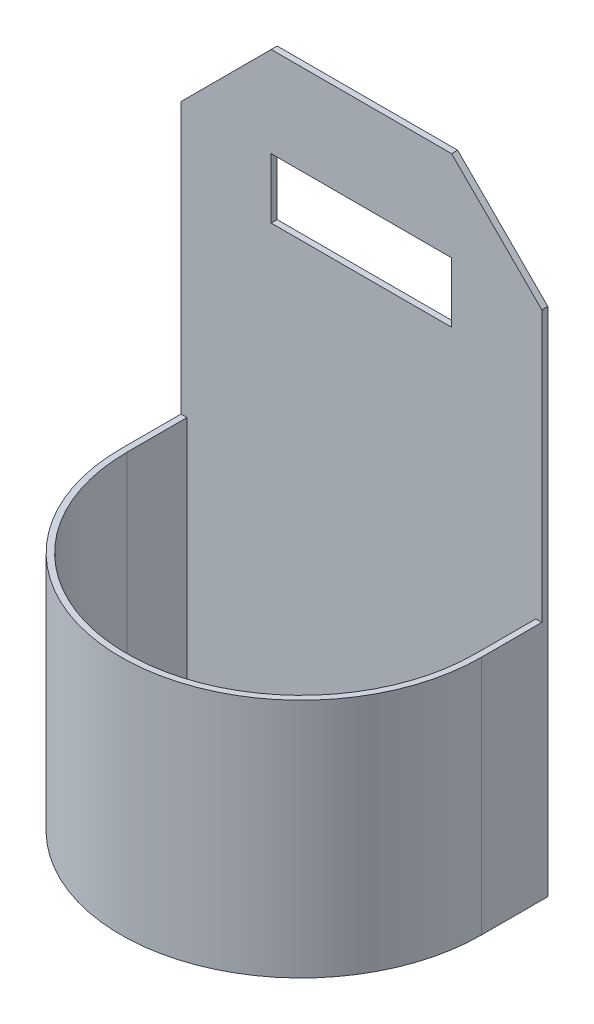
ISO-10303-21;
HEADER;
FILE_DESCRIPTION(('STEP AP214'),'2;1');
FILE_NAME('part.step','',(''),(''),'','','');
FILE_SCHEMA(('AUTOMOTIVE_DESIGN { 1 0 10303 214 1 1 1 1 }'));
ENDSEC;
DATA;
#1=APPLICATION_CONTEXT('core data for automotive mechanical design processes');
#2=APPLICATION_PROTOCOL_DEFINITION('international standard','automotive_design',2000,#1);
#3=PRODUCT_CONTEXT('',#1,'mechanical');
#4=PRODUCT('Part','Part','',(#3));
#5=PRODUCT_RELATED_PRODUCT_CATEGORY('part','',(#4));
#6=PRODUCT_DEFINITION_FORMATION('','',#4);
#7=PRODUCT_DEFINITION_CONTEXT('part definition',#1,'design');
#8=PRODUCT_DEFINITION('design','',#6,#7);
#9=PRODUCT_DEFINITION_SHAPE('','',#8);
#10=(LENGTH_UNIT() NAMED_UNIT(*) SI_UNIT(.MILLI.,.METRE.));
#11=(NAMED_UNIT(*) PLANE_ANGLE_UNIT() SI_UNIT($,.RADIAN.));
#12=(NAMED_UNIT(*) SI_UNIT($,.STERADIAN.) SOLID_ANGLE_UNIT());
#13=UNCERTAINTY_MEASURE_WITH_UNIT(LENGTH_MEASURE(1.E-05),#10,'distance_accuracy_value','');
#14=(GEOMETRIC_REPRESENTATION_CONTEXT(3) GLOBAL_UNCERTAINTY_ASSIGNED_CONTEXT((#13)) GLOBAL_UNIT_ASSIGNED_CONTEXT((#10,
#11,#12)) REPRESENTATION_CONTEXT('',''));
#15=CARTESIAN_POINT('',(0.,0.,0.));
#16=DIRECTION('',(0.,0.,1.));
#17=DIRECTION('',(1.,0.,0.));
#18=AXIS2_PLACEMENT_3D('',#15,#16,#17);
#19=CARTESIAN_POINT('',(0.,100.,1.));
#20=DIRECTION('',(0.,0.,-1.));
#21=DIRECTION('',(-1.,0.,0.));
#22=AXIS2_PLACEMENT_3D('',#19,#20,#21);
#23=PLANE('',#22);
#24=DIRECTION('',(0.,1.,0.));
#25=VECTOR('',#24,1.);
#26=CARTESIAN_POINT('',(45.,85.,1.));
#27=LINE('',#26,#25);
#28=CARTESIAN_POINT('',(45.,75.,1.));
#29=VERTEX_POINT('',#28);
#30=CARTESIAN_POINT('',(45.,85.,1.));
#31=VERTEX_POINT('',#30);
#32=EDGE_CURVE('E232',#29,#31,#27,.T.);
#33=ORIENTED_EDGE('',*,*,#32,.F.);
#34=DIRECTION('',(1.,0.,0.));
#35=VECTOR('',#34,1.);
#36=CARTESIAN_POINT('',(15.,75.,1.));
#37=LINE('',#36,#35);
#38=CARTESIAN_POINT('',(15.,75.,1.));
#39=VERTEX_POINT('',#38);
#40=EDGE_CURVE('E240',#39,#29,#37,.T.);
#41=ORIENTED_EDGE('',*,*,#40,.F.);
#42=DIRECTION('',(0.,-1.,0.));
#43=VECTOR('',#42,1.);
#44=CARTESIAN_POINT('',(15.,85.,1.));
#45=LINE('',#44,#43);
#46=CARTESIAN_POINT('',(15.,85.,1.));
#47=VERTEX_POINT('',#46);
#48=EDGE_CURVE('E237',#47,#39,#45,.T.);
#49=ORIENTED_EDGE('',*,*,#48,.F.);
#50=DIRECTION('',(-1.,0.,0.));
#51=VECTOR('',#50,1.);
#52=CARTESIAN_POINT('',(15.,85.,1.));
#53=LINE('',#52,#51);
#54=EDGE_CURVE('E234',#31,#47,#53,.T.);
#55=ORIENTED_EDGE('',*,*,#54,.F.);
#56=EDGE_LOOP('',(#33,#41,#49,#55));
#57=FACE_BOUND('',#56,.T.);
#58=DIRECTION('',(-1.,0.,0.));
#59=VECTOR('',#58,1.);
#60=CARTESIAN_POINT('',(0.,40.,1.));
#61=LINE('',#60,#59);
#62=CARTESIAN_POINT('',(60.,40.,1.));
#63=VERTEX_POINT('',#62);
#64=CARTESIAN_POINT('',(59.,40.,1.));
#65=VERTEX_POINT('',#64);
#66=EDGE_CURVE('E57',#63,#65,#61,.T.);
#67=ORIENTED_EDGE('',*,*,#66,.F.);
#68=DIRECTION('',(0.,1.,0.));
#69=VECTOR('',#68,1.);
#70=CARTESIAN_POINT('',(60.,0.,1.));
#71=LINE('',#70,#69);
#72=CARTESIAN_POINT('',(60.,85.,1.));
#73=VERTEX_POINT('',#72);
#74=EDGE_CURVE('E190',#63,#73,#71,.T.);
#75=ORIENTED_EDGE('',*,*,#74,.T.);
#76=DIRECTION('',(-0.707106781186547,0.707106781186547,0.));
#77=VECTOR('',#76,1.);
#78=CARTESIAN_POINT('',(45.,100.,1.));
#79=LINE('',#78,#77);
#80=CARTESIAN_POINT('',(45.,100.,1.));
#81=VERTEX_POINT('',#80);
#82=EDGE_CURVE('E288',#73,#81,#79,.T.);
#83=ORIENTED_EDGE('',*,*,#82,.T.);
#84=DIRECTION('',(-1.,0.,0.));
#85=VECTOR('',#84,1.);
#86=CARTESIAN_POINT('',(15.,100.,1.));
#87=LINE('',#86,#85);
#88=CARTESIAN_POINT('',(15.,100.,1.));
#89=VERTEX_POINT('',#88);
#90=EDGE_CURVE('E287',#81,#89,#87,.T.);
#91=ORIENTED_EDGE('',*,*,#90,.T.);
#92=DIRECTION('',(-0.707106781186547,-0.707106781186547,0.));
#93=VECTOR('',#92,1.);
#94=CARTESIAN_POINT('',(0.,85.,1.));
#95=LINE('',#94,#93);
#96=CARTESIAN_POINT('',(0.,85.,1.));
#97=VERTEX_POINT('',#96);
#98=EDGE_CURVE('E209',#89,#97,#95,.T.);
#99=ORIENTED_EDGE('',*,*,#98,.T.);
#100=DIRECTION('',(0.,-1.,0.));
#101=VECTOR('',#100,1.);
#102=CARTESIAN_POINT('',(0.,0.,1.));
#103=LINE('',#102,#101);
#104=CARTESIAN_POINT('',(0.,40.,1.));
#105=VERTEX_POINT('',#104);
#106=EDGE_CURVE('E207',#97,#105,#103,.T.);
#107=ORIENTED_EDGE('',*,*,#106,.T.);
#108=CARTESIAN_POINT('',(1.,40.,1.));
#109=VERTEX_POINT('',#108);
#110=EDGE_CURVE('E35',#109,#105,#61,.T.);
#111=ORIENTED_EDGE('',*,*,#110,.F.);
#112=DIRECTION('',(0.,-1.,0.));
#113=VECTOR('',#112,1.);
#114=CARTESIAN_POINT('',(1.,100.,1.));
#115=LINE('',#114,#113);
#116=CARTESIAN_POINT('',(1.,1.,1.));
#117=VERTEX_POINT('',#116);
#118=EDGE_CURVE('E176',#109,#117,#115,.T.);
#119=ORIENTED_EDGE('',*,*,#118,.T.);
#120=DIRECTION('',(1.,0.,0.));
#121=VECTOR('',#120,1.);
#122=CARTESIAN_POINT('',(0.,1.,1.));
#123=LINE('',#122,#121);
#124=CARTESIAN_POINT('',(59.,1.,1.));
#125=VERTEX_POINT('',#124);
#126=EDGE_CURVE('E154',#117,#125,#123,.T.);
#127=ORIENTED_EDGE('',*,*,#126,.T.);
#128=DIRECTION('',(0.,1.,0.));
#129=VECTOR('',#128,1.);
#130=CARTESIAN_POINT('',(59.,100.,1.));
#131=LINE('',#130,#129);
#132=EDGE_CURVE('E487',#125,#65,#131,.T.);
#133=ORIENTED_EDGE('',*,*,#132,.T.);
#134=EDGE_LOOP('',(#67,#75,#83,#91,#99,#107,#111,#119,#127,#133));
#135=FACE_BOUND('',#134,.T.);
#136=ADVANCED_FACE('F31',(#57,#135),#23,.F.);
#137=CARTESIAN_POINT('',(0.,100.,0.));
#138=DIRECTION('',(0.,0.,-1.));
#139=DIRECTION('',(-1.,0.,0.));
#140=AXIS2_PLACEMENT_3D('',#137,#138,#139);
#141=PLANE('',#140);
#142=DIRECTION('',(0.,-1.,0.));
#143=VECTOR('',#142,1.);
#144=CARTESIAN_POINT('',(0.,0.,0.));
#145=LINE('',#144,#143);
#146=CARTESIAN_POINT('',(0.,85.,0.));
#147=VERTEX_POINT('',#146);
#148=CARTESIAN_POINT('',(0.,0.,0.));
#149=VERTEX_POINT('',#148);
#150=EDGE_CURVE('E259',#147,#149,#145,.T.);
#151=ORIENTED_EDGE('',*,*,#150,.F.);
#152=DIRECTION('',(-0.707106781186547,-0.707106781186547,0.));
#153=VECTOR('',#152,1.);
#154=CARTESIAN_POINT('',(0.,85.,0.));
#155=LINE('',#154,#153);
#156=CARTESIAN_POINT('',(15.,100.,0.));
#157=VERTEX_POINT('',#156);
#158=EDGE_CURVE('E213',#157,#147,#155,.T.);
#159=ORIENTED_EDGE('',*,*,#158,.F.);
#160=DIRECTION('',(-1.,0.,0.));
#161=VECTOR('',#160,1.);
#162=CARTESIAN_POINT('',(15.,100.,0.));
#163=LINE('',#162,#161);
#164=CARTESIAN_POINT('',(45.,100.,0.));
#165=VERTEX_POINT('',#164);
#166=EDGE_CURVE('E277',#165,#157,#163,.T.);
#167=ORIENTED_EDGE('',*,*,#166,.F.);
#168=DIRECTION('',(-0.707106781186547,0.707106781186547,0.));
#169=VECTOR('',#168,1.);
#170=CARTESIAN_POINT('',(45.,100.,0.));
#171=LINE('',#170,#169);
#172=CARTESIAN_POINT('',(60.,85.,0.));
#173=VERTEX_POINT('',#172);
#174=EDGE_CURVE('E279',#173,#165,#171,.T.);
#175=ORIENTED_EDGE('',*,*,#174,.F.);
#176=DIRECTION('',(0.,1.,0.));
#177=VECTOR('',#176,1.);
#178=CARTESIAN_POINT('',(60.,0.,0.));
#179=LINE('',#178,#177);
#180=CARTESIAN_POINT('',(60.,0.,0.));
#181=VERTEX_POINT('',#180);
#182=EDGE_CURVE('E281',#181,#173,#179,.T.);
#183=ORIENTED_EDGE('',*,*,#182,.F.);
#184=DIRECTION('',(1.,0.,0.));
#185=VECTOR('',#184,1.);
#186=CARTESIAN_POINT('',(0.,0.,0.));
#187=LINE('',#186,#185);
#188=EDGE_CURVE('E283',#149,#181,#187,.T.);
#189=ORIENTED_EDGE('',*,*,#188,.F.);
#190=EDGE_LOOP('',(#151,#159,#167,#175,#183,#189));
#191=FACE_BOUND('',#190,.T.);
#192=DIRECTION('',(1.,0.,0.));
#193=VECTOR('',#192,1.);
#194=CARTESIAN_POINT('',(15.,75.,0.));
#195=LINE('',#194,#193);
#196=CARTESIAN_POINT('',(15.,75.,0.));
#197=VERTEX_POINT('',#196);
#198=CARTESIAN_POINT('',(45.,75.,0.));
#199=VERTEX_POINT('',#198);
#200=EDGE_CURVE('E235',#197,#199,#195,.T.);
#201=ORIENTED_EDGE('',*,*,#200,.T.);
#202=DIRECTION('',(0.,1.,0.));
#203=VECTOR('',#202,1.);
#204=CARTESIAN_POINT('',(45.,85.,0.));
#205=LINE('',#204,#203);
#206=CARTESIAN_POINT('',(45.,85.,0.));
#207=VERTEX_POINT('',#206);
#208=EDGE_CURVE('E226',#199,#207,#205,.T.);
#209=ORIENTED_EDGE('',*,*,#208,.T.);
#210=DIRECTION('',(-1.,0.,0.));
#211=VECTOR('',#210,1.);
#212=CARTESIAN_POINT('',(15.,85.,0.));
#213=LINE('',#212,#211);
#214=CARTESIAN_POINT('',(15.,85.,0.));
#215=VERTEX_POINT('',#214);
#216=EDGE_CURVE('E229',#207,#215,#213,.T.);
#217=ORIENTED_EDGE('',*,*,#216,.T.);
#218=DIRECTION('',(0.,-1.,0.));
#219=VECTOR('',#218,1.);
#220=CARTESIAN_POINT('',(15.,85.,0.));
#221=LINE('',#220,#219);
#222=EDGE_CURVE('E245',#215,#197,#221,.T.);
#223=ORIENTED_EDGE('',*,*,#222,.T.);
#224=EDGE_LOOP('',(#201,#209,#217,#223));
#225=FACE_BOUND('',#224,.T.);
#226=ADVANCED_FACE('F307',(#191,#225),#141,.T.);
#227=CARTESIAN_POINT('',(0.,0.,1.));
#228=DIRECTION('',(1.,0.,0.));
#229=DIRECTION('',(0.,0.,-1.));
#230=AXIS2_PLACEMENT_3D('',#227,#228,#229);
#231=PLANE('',#230);
#232=ORIENTED_EDGE('',*,*,#150,.T.);
#233=DIRECTION('',(0.,0.,-1.));
#234=VECTOR('',#233,1.);
#235=CARTESIAN_POINT('',(0.,0.,1.));
#236=LINE('',#235,#234);
#237=CARTESIAN_POINT('',(0.,0.,11.));
#238=VERTEX_POINT('',#237);
#239=EDGE_CURVE('E11',#238,#149,#236,.T.);
#240=ORIENTED_EDGE('',*,*,#239,.F.);
#241=DIRECTION('',(0.,-1.,0.));
#242=VECTOR('',#241,1.);
#243=CARTESIAN_POINT('',(0.,40.,11.));
#244=LINE('',#243,#242);
#245=CARTESIAN_POINT('',(0.,40.,11.));
#246=VERTEX_POINT('',#245);
#247=EDGE_CURVE('E194',#246,#238,#244,.T.);
#248=ORIENTED_EDGE('',*,*,#247,.F.);
#249=DIRECTION('',(0.,0.,1.));
#250=VECTOR('',#249,1.);
#251=CARTESIAN_POINT('',(0.,40.,1.));
#252=LINE('',#251,#250);
#253=EDGE_CURVE('E189',#105,#246,#252,.T.);
#254=ORIENTED_EDGE('',*,*,#253,.F.);
#255=ORIENTED_EDGE('',*,*,#106,.F.);
#256=DIRECTION('',(0.,0.,-1.));
#257=VECTOR('',#256,1.);
#258=CARTESIAN_POINT('',(0.,85.,1.));
#259=LINE('',#258,#257);
#260=EDGE_CURVE('E274',#97,#147,#259,.T.);
#261=ORIENTED_EDGE('',*,*,#260,.T.);
#262=EDGE_LOOP('',(#232,#240,#248,#254,#255,#261));
#263=FACE_BOUND('',#262,.T.);
#264=ADVANCED_FACE('F33',(#263),#231,.F.);
#265=CARTESIAN_POINT('',(0.,0.,1.));
#266=DIRECTION('',(0.,1.,0.));
#267=DIRECTION('',(0.,0.,1.));
#268=AXIS2_PLACEMENT_3D('',#265,#266,#267);
#269=PLANE('',#268);
#270=ORIENTED_EDGE('',*,*,#188,.T.);
#271=DIRECTION('',(0.,0.,-1.));
#272=VECTOR('',#271,1.);
#273=CARTESIAN_POINT('',(60.,0.,1.));
#274=LINE('',#273,#272);
#275=CARTESIAN_POINT('',(60.,0.,11.));
#276=VERTEX_POINT('',#275);
#277=EDGE_CURVE('E41',#276,#181,#274,.T.);
#278=ORIENTED_EDGE('',*,*,#277,.F.);
#279=CARTESIAN_POINT('',(30.,0.,11.));
#280=DIRECTION('',(0.,1.,0.));
#281=DIRECTION('',(0.,0.,1.));
#282=AXIS2_PLACEMENT_3D('',#279,#280,#281);
#283=CIRCLE('',#282,30.);
#284=EDGE_CURVE('E156',#238,#276,#283,.T.);
#285=ORIENTED_EDGE('',*,*,#284,.F.);
#286=ORIENTED_EDGE('',*,*,#239,.T.);
#287=EDGE_LOOP('',(#270,#278,#285,#286));
#288=FACE_BOUND('',#287,.T.);
#289=ADVANCED_FACE('F310',(#288),#269,.F.);
#290=CARTESIAN_POINT('',(60.,0.,1.));
#291=DIRECTION('',(-1.,0.,0.));
#292=DIRECTION('',(0.,-1.,0.));
#293=AXIS2_PLACEMENT_3D('',#290,#291,#292);
#294=PLANE('',#293);
#295=ORIENTED_EDGE('',*,*,#182,.T.);
#296=DIRECTION('',(0.,0.,-1.));
#297=VECTOR('',#296,1.);
#298=CARTESIAN_POINT('',(60.,85.,1.));
#299=LINE('',#298,#297);
#300=EDGE_CURVE('E265',#73,#173,#299,.T.);
#301=ORIENTED_EDGE('',*,*,#300,.F.);
#302=ORIENTED_EDGE('',*,*,#74,.F.);
#303=DIRECTION('',(0.,0.,-1.));
#304=VECTOR('',#303,1.);
#305=CARTESIAN_POINT('',(60.,40.,0.999999999999984));
#306=LINE('',#305,#304);
#307=CARTESIAN_POINT('',(60.,40.,11.));
#308=VERTEX_POINT('',#307);
#309=EDGE_CURVE('E181',#308,#63,#306,.T.);
#310=ORIENTED_EDGE('',*,*,#309,.F.);
#311=DIRECTION('',(0.,-1.,0.));
#312=VECTOR('',#311,1.);
#313=CARTESIAN_POINT('',(60.,40.,11.));
#314=LINE('',#313,#312);
#315=EDGE_CURVE('E220',#308,#276,#314,.T.);
#316=ORIENTED_EDGE('',*,*,#315,.T.);
#317=ORIENTED_EDGE('',*,*,#277,.T.);
#318=EDGE_LOOP('',(#295,#301,#302,#310,#316,#317));
#319=FACE_BOUND('',#318,.T.);
#320=ADVANCED_FACE('F292',(#319),#294,.F.);
#321=CARTESIAN_POINT('',(45.,100.,1.));
#322=DIRECTION('',(-0.707106781186547,-0.707106781186547,0.));
#323=DIRECTION('',(0.707106781186548,-0.707106781186548,0.));
#324=AXIS2_PLACEMENT_3D('',#321,#322,#323);
#325=PLANE('',#324);
#326=ORIENTED_EDGE('',*,*,#174,.T.);
#327=DIRECTION('',(0.,0.,-1.));
#328=VECTOR('',#327,1.);
#329=CARTESIAN_POINT('',(45.,100.,1.));
#330=LINE('',#329,#328);
#331=EDGE_CURVE('E268',#81,#165,#330,.T.);
#332=ORIENTED_EDGE('',*,*,#331,.F.);
#333=ORIENTED_EDGE('',*,*,#82,.F.);
#334=ORIENTED_EDGE('',*,*,#300,.T.);
#335=EDGE_LOOP('',(#326,#332,#333,#334));
#336=FACE_BOUND('',#335,.T.);
#337=ADVANCED_FACE('F296',(#336),#325,.F.);
#338=CARTESIAN_POINT('',(15.,100.,1.));
#339=DIRECTION('',(0.,-1.,0.));
#340=DIRECTION('',(0.,0.,-1.));
#341=AXIS2_PLACEMENT_3D('',#338,#339,#340);
#342=PLANE('',#341);
#343=ORIENTED_EDGE('',*,*,#166,.T.);
#344=DIRECTION('',(0.,0.,-1.));
#345=VECTOR('',#344,1.);
#346=CARTESIAN_POINT('',(15.,100.,1.));
#347=LINE('',#346,#345);
#348=EDGE_CURVE('E271',#89,#157,#347,.T.);
#349=ORIENTED_EDGE('',*,*,#348,.F.);
#350=ORIENTED_EDGE('',*,*,#90,.F.);
#351=ORIENTED_EDGE('',*,*,#331,.T.);
#352=EDGE_LOOP('',(#343,#349,#350,#351));
#353=FACE_BOUND('',#352,.T.);
#354=ADVANCED_FACE('F301',(#353),#342,.F.);
#355=CARTESIAN_POINT('',(0.,85.,1.));
#356=DIRECTION('',(0.707106781186547,-0.707106781186547,0.));
#357=DIRECTION('',(0.707106781186548,0.707106781186548,0.));
#358=AXIS2_PLACEMENT_3D('',#355,#356,#357);
#359=PLANE('',#358);
#360=ORIENTED_EDGE('',*,*,#158,.T.);
#361=ORIENTED_EDGE('',*,*,#260,.F.);
#362=ORIENTED_EDGE('',*,*,#98,.F.);
#363=ORIENTED_EDGE('',*,*,#348,.T.);
#364=EDGE_LOOP('',(#360,#361,#362,#363));
#365=FACE_BOUND('',#364,.T.);
#366=ADVANCED_FACE('F304',(#365),#359,.F.);
#367=CARTESIAN_POINT('',(45.,85.,1.));
#368=DIRECTION('',(-1.,0.,0.));
#369=DIRECTION('',(0.,0.,1.));
#370=AXIS2_PLACEMENT_3D('',#367,#368,#369);
#371=PLANE('',#370);
#372=ORIENTED_EDGE('',*,*,#208,.F.);
#373=DIRECTION('',(0.,0.,-1.));
#374=VECTOR('',#373,1.);
#375=CARTESIAN_POINT('',(45.,75.,1.));
#376=LINE('',#375,#374);
#377=EDGE_CURVE('E241',#29,#199,#376,.T.);
#378=ORIENTED_EDGE('',*,*,#377,.F.);
#379=ORIENTED_EDGE('',*,*,#32,.T.);
#380=DIRECTION('',(0.,0.,-1.));
#381=VECTOR('',#380,1.);
#382=CARTESIAN_POINT('',(45.,85.,1.));
#383=LINE('',#382,#381);
#384=EDGE_CURVE('E256',#31,#207,#383,.T.);
#385=ORIENTED_EDGE('',*,*,#384,.T.);
#386=EDGE_LOOP('',(#372,#378,#379,#385));
#387=FACE_BOUND('',#386,.T.);
#388=ADVANCED_FACE('F326',(#387),#371,.T.);
#389=CARTESIAN_POINT('',(15.,85.,1.));
#390=DIRECTION('',(0.,-1.,0.));
#391=DIRECTION('',(0.,0.,-1.));
#392=AXIS2_PLACEMENT_3D('',#389,#390,#391);
#393=PLANE('',#392);
#394=ORIENTED_EDGE('',*,*,#216,.F.);
#395=ORIENTED_EDGE('',*,*,#384,.F.);
#396=ORIENTED_EDGE('',*,*,#54,.T.);
#397=DIRECTION('',(0.,0.,-1.));
#398=VECTOR('',#397,1.);
#399=CARTESIAN_POINT('',(15.,85.,1.));
#400=LINE('',#399,#398);
#401=EDGE_CURVE('E254',#47,#215,#400,.T.);
#402=ORIENTED_EDGE('',*,*,#401,.T.);
#403=EDGE_LOOP('',(#394,#395,#396,#402));
#404=FACE_BOUND('',#403,.T.);
#405=ADVANCED_FACE('F353',(#404),#393,.T.);
#406=CARTESIAN_POINT('',(15.,85.,1.));
#407=DIRECTION('',(1.,0.,0.));
#408=DIRECTION('',(0.,1.,0.));
#409=AXIS2_PLACEMENT_3D('',#406,#407,#408);
#410=PLANE('',#409);
#411=ORIENTED_EDGE('',*,*,#222,.F.);
#412=ORIENTED_EDGE('',*,*,#401,.F.);
#413=ORIENTED_EDGE('',*,*,#48,.T.);
#414=DIRECTION('',(0.,0.,-1.));
#415=VECTOR('',#414,1.);
#416=CARTESIAN_POINT('',(15.,75.,1.));
#417=LINE('',#416,#415);
#418=EDGE_CURVE('E252',#39,#197,#417,.T.);
#419=ORIENTED_EDGE('',*,*,#418,.T.);
#420=EDGE_LOOP('',(#411,#412,#413,#419));
#421=FACE_BOUND('',#420,.T.);
#422=ADVANCED_FACE('F360',(#421),#410,.T.);
#423=CARTESIAN_POINT('',(15.,75.,1.));
#424=DIRECTION('',(0.,1.,0.));
#425=DIRECTION('',(0.,0.,1.));
#426=AXIS2_PLACEMENT_3D('',#423,#424,#425);
#427=PLANE('',#426);
#428=ORIENTED_EDGE('',*,*,#200,.F.);
#429=ORIENTED_EDGE('',*,*,#418,.F.);
#430=ORIENTED_EDGE('',*,*,#40,.T.);
#431=ORIENTED_EDGE('',*,*,#377,.T.);
#432=EDGE_LOOP('',(#428,#429,#430,#431));
#433=FACE_BOUND('',#432,.T.);
#434=ADVANCED_FACE('F367',(#433),#427,.T.);
#435=CARTESIAN_POINT('',(30.,40.,11.));
#436=DIRECTION('',(0.,-1.,0.));
#437=DIRECTION('',(0.,0.,-1.));
#438=AXIS2_PLACEMENT_3D('',#435,#436,#437);
#439=CYLINDRICAL_SURFACE('',#438,30.);
#440=ORIENTED_EDGE('',*,*,#284,.T.);
#441=ORIENTED_EDGE('',*,*,#315,.F.);
#442=CARTESIAN_POINT('',(30.,40.,11.));
#443=DIRECTION('',(0.,1.,0.));
#444=DIRECTION('',(0.,0.,1.));
#445=AXIS2_PLACEMENT_3D('',#442,#443,#444);
#446=CIRCLE('',#445,30.);
#447=EDGE_CURVE('E179',#246,#308,#446,.T.);
#448=ORIENTED_EDGE('',*,*,#447,.F.);
#449=ORIENTED_EDGE('',*,*,#247,.T.);
#450=EDGE_LOOP('',(#440,#441,#448,#449));
#451=FACE_BOUND('',#450,.T.);
#452=ADVANCED_FACE('F222',(#451),#439,.T.);
#453=CARTESIAN_POINT('',(30.,40.,11.));
#454=DIRECTION('',(0.,1.,0.));
#455=DIRECTION('',(0.,0.,1.));
#456=AXIS2_PLACEMENT_3D('',#453,#454,#455);
#457=PLANE('',#456);
#458=DIRECTION('',(0.,0.,-1.));
#459=VECTOR('',#458,1.);
#460=CARTESIAN_POINT('',(59.,40.,1.));
#461=LINE('',#460,#459);
#462=CARTESIAN_POINT('',(59.,40.,11.));
#463=VERTEX_POINT('',#462);
#464=EDGE_CURVE('E170',#463,#65,#461,.T.);
#465=ORIENTED_EDGE('',*,*,#464,.F.);
#466=CARTESIAN_POINT('',(30.,40.,11.));
#467=DIRECTION('',(0.,1.,0.));
#468=DIRECTION('',(0.,0.,1.));
#469=AXIS2_PLACEMENT_3D('',#466,#467,#468);
#470=CIRCLE('',#469,29.);
#471=CARTESIAN_POINT('',(1.,40.,11.));
#472=VERTEX_POINT('',#471);
#473=EDGE_CURVE('E168',#472,#463,#470,.T.);
#474=ORIENTED_EDGE('',*,*,#473,.F.);
#475=DIRECTION('',(0.,0.,1.));
#476=VECTOR('',#475,1.);
#477=CARTESIAN_POINT('',(1.,40.,1.));
#478=LINE('',#477,#476);
#479=EDGE_CURVE('E161',#109,#472,#478,.T.);
#480=ORIENTED_EDGE('',*,*,#479,.F.);
#481=ORIENTED_EDGE('',*,*,#110,.T.);
#482=ORIENTED_EDGE('',*,*,#253,.T.);
#483=ORIENTED_EDGE('',*,*,#447,.T.);
#484=ORIENTED_EDGE('',*,*,#309,.T.);
#485=ORIENTED_EDGE('',*,*,#66,.T.);
#486=EDGE_LOOP('',(#465,#474,#480,#481,#482,#483,#484,#485));
#487=FACE_BOUND('',#486,.T.);
#488=ADVANCED_FACE('F203',(#487),#457,.T.);
#489=CARTESIAN_POINT('',(1.,0.,1.));
#490=DIRECTION('',(1.,0.,0.));
#491=DIRECTION('',(0.,0.,-1.));
#492=AXIS2_PLACEMENT_3D('',#489,#490,#491);
#493=PLANE('',#492);
#494=ORIENTED_EDGE('',*,*,#479,.T.);
#495=DIRECTION('',(0.,-1.,0.));
#496=VECTOR('',#495,1.);
#497=CARTESIAN_POINT('',(0.999999999999997,40.,11.));
#498=LINE('',#497,#496);
#499=CARTESIAN_POINT('',(0.999999999999997,1.,11.));
#500=VERTEX_POINT('',#499);
#501=EDGE_CURVE('E49',#472,#500,#498,.T.);
#502=ORIENTED_EDGE('',*,*,#501,.T.);
#503=DIRECTION('',(0.,0.,-1.));
#504=VECTOR('',#503,1.);
#505=CARTESIAN_POINT('',(1.,1.,1.));
#506=LINE('',#505,#504);
#507=EDGE_CURVE('E150',#500,#117,#506,.T.);
#508=ORIENTED_EDGE('',*,*,#507,.T.);
#509=ORIENTED_EDGE('',*,*,#118,.F.);
#510=EDGE_LOOP('',(#494,#502,#508,#509));
#511=FACE_BOUND('',#510,.T.);
#512=ADVANCED_FACE('F159',(#511),#493,.T.);
#513=CARTESIAN_POINT('',(0.,1.,1.));
#514=DIRECTION('',(0.,1.,0.));
#515=DIRECTION('',(0.,0.,1.));
#516=AXIS2_PLACEMENT_3D('',#513,#514,#515);
#517=PLANE('',#516);
#518=ORIENTED_EDGE('',*,*,#126,.F.);
#519=ORIENTED_EDGE('',*,*,#507,.F.);
#520=CARTESIAN_POINT('',(30.,1.,11.));
#521=DIRECTION('',(0.,1.,0.));
#522=DIRECTION('',(0.,0.,1.));
#523=AXIS2_PLACEMENT_3D('',#520,#521,#522);
#524=CIRCLE('',#523,29.);
#525=CARTESIAN_POINT('',(59.,1.,11.));
#526=VERTEX_POINT('',#525);
#527=EDGE_CURVE('E153',#500,#526,#524,.T.);
#528=ORIENTED_EDGE('',*,*,#527,.T.);
#529=DIRECTION('',(0.,0.,-1.));
#530=VECTOR('',#529,1.);
#531=CARTESIAN_POINT('',(59.,1.,1.));
#532=LINE('',#531,#530);
#533=EDGE_CURVE('E157',#526,#125,#532,.T.);
#534=ORIENTED_EDGE('',*,*,#533,.T.);
#535=EDGE_LOOP('',(#518,#519,#528,#534));
#536=FACE_BOUND('',#535,.T.);
#537=ADVANCED_FACE('F151',(#536),#517,.T.);
#538=CARTESIAN_POINT('',(59.,0.,1.));
#539=DIRECTION('',(-1.,0.,0.));
#540=DIRECTION('',(0.,-1.,0.));
#541=AXIS2_PLACEMENT_3D('',#538,#539,#540);
#542=PLANE('',#541);
#543=ORIENTED_EDGE('',*,*,#132,.F.);
#544=ORIENTED_EDGE('',*,*,#533,.F.);
#545=DIRECTION('',(0.,-1.,0.));
#546=VECTOR('',#545,1.);
#547=CARTESIAN_POINT('',(59.,0.,11.));
#548=LINE('',#547,#546);
#549=EDGE_CURVE('E163',#463,#526,#548,.T.);
#550=ORIENTED_EDGE('',*,*,#549,.F.);
#551=ORIENTED_EDGE('',*,*,#464,.T.);
#552=EDGE_LOOP('',(#543,#544,#550,#551));
#553=FACE_BOUND('',#552,.T.);
#554=ADVANCED_FACE('F401',(#553),#542,.T.);
#555=CARTESIAN_POINT('',(30.,40.,11.));
#556=DIRECTION('',(0.,-1.,0.));
#557=DIRECTION('',(0.,0.,-1.));
#558=AXIS2_PLACEMENT_3D('',#555,#556,#557);
#559=CYLINDRICAL_SURFACE('',#558,29.);
#560=ORIENTED_EDGE('',*,*,#527,.F.);
#561=ORIENTED_EDGE('',*,*,#501,.F.);
#562=ORIENTED_EDGE('',*,*,#473,.T.);
#563=ORIENTED_EDGE('',*,*,#549,.T.);
#564=EDGE_LOOP('',(#560,#561,#562,#563));
#565=FACE_BOUND('',#564,.T.);
#566=ADVANCED_FACE('F166',(#565),#559,.F.);
#567=CLOSED_SHELL('',(#136,#226,#264,#289,#320,#337,#354,#366,#388,#405,#422,#434,#452,#488,
#512,#537,#554,#566));
#568=MANIFOLD_SOLID_BREP('B2',#567);
#569=ADVANCED_BREP_SHAPE_REPRESENTATION('',(#18,#568),#14);
#570=SHAPE_DEFINITION_REPRESENTATION(#9,#569);
ENDSEC;
END-ISO-10303-21;
